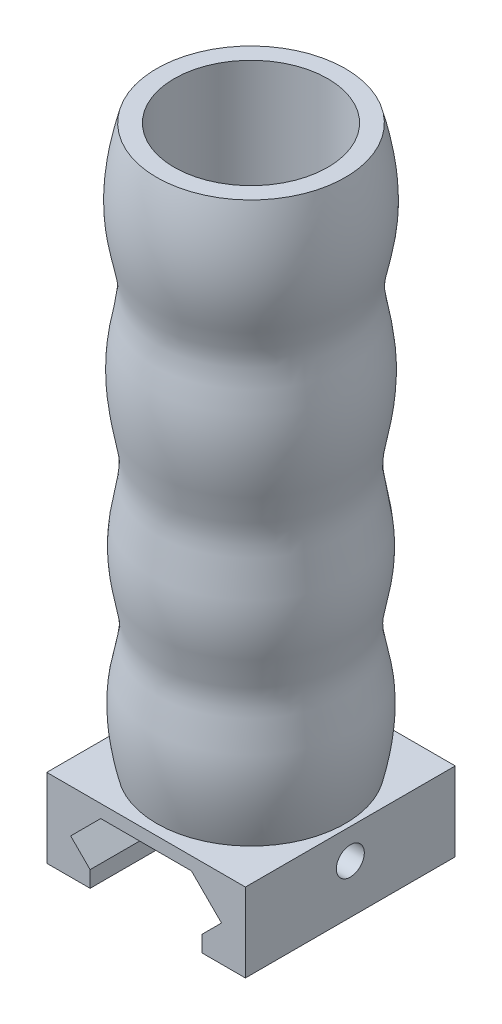
ISO-10303-21;
HEADER;
FILE_DESCRIPTION(('STEP AP214'),'2;1');
FILE_NAME('part.step','',(''),(''),'','','');
FILE_SCHEMA(('AUTOMOTIVE_DESIGN { 1 0 10303 214 1 1 1 1 }'));
ENDSEC;
DATA;
#1=APPLICATION_CONTEXT('core data for automotive mechanical design processes');
#2=APPLICATION_PROTOCOL_DEFINITION('international standard','automotive_design',2000,#1);
#3=PRODUCT_CONTEXT('',#1,'mechanical');
#4=PRODUCT('Part','Part','',(#3));
#5=PRODUCT_RELATED_PRODUCT_CATEGORY('part','',(#4));
#6=PRODUCT_DEFINITION_FORMATION('','',#4);
#7=PRODUCT_DEFINITION_CONTEXT('part definition',#1,'design');
#8=PRODUCT_DEFINITION('design','',#6,#7);
#9=PRODUCT_DEFINITION_SHAPE('','',#8);
#10=(LENGTH_UNIT() NAMED_UNIT(*) SI_UNIT(.MILLI.,.METRE.));
#11=(NAMED_UNIT(*) PLANE_ANGLE_UNIT() SI_UNIT($,.RADIAN.));
#12=(NAMED_UNIT(*) SI_UNIT($,.STERADIAN.) SOLID_ANGLE_UNIT());
#13=UNCERTAINTY_MEASURE_WITH_UNIT(LENGTH_MEASURE(1.E-05),#10,'distance_accuracy_value','');
#14=(GEOMETRIC_REPRESENTATION_CONTEXT(3) GLOBAL_UNCERTAINTY_ASSIGNED_CONTEXT((#13)) GLOBAL_UNIT_ASSIGNED_CONTEXT((#10,
#11,#12)) REPRESENTATION_CONTEXT('',''));
#15=CARTESIAN_POINT('',(0.,0.,0.));
#16=DIRECTION('',(0.,0.,1.));
#17=DIRECTION('',(1.,0.,0.));
#18=AXIS2_PLACEMENT_3D('',#15,#16,#17);
#19=CARTESIAN_POINT('',(14.2,13.7619104655193,30.));
#20=DIRECTION('',(0.,-1.,0.));
#21=DIRECTION('',(1.,0.,0.));
#22=AXIS2_PLACEMENT_3D('',#19,#20,#21);
#23=PLANE('',#22);
#24=DIRECTION('',(-1.,0.,0.));
#25=VECTOR('',#24,1.);
#26=CARTESIAN_POINT('',(14.2,13.7619104655193,0.));
#27=LINE('',#26,#25);
#28=CARTESIAN_POINT('',(14.2,13.7619104655193,0.));
#29=VERTEX_POINT('',#28);
#30=CARTESIAN_POINT('',(-14.2,13.7619104655193,0.));
#31=VERTEX_POINT('',#30);
#32=EDGE_CURVE('E205',#29,#31,#27,.T.);
#33=ORIENTED_EDGE('',*,*,#32,.T.);
#34=DIRECTION('',(0.,0.,-1.));
#35=VECTOR('',#34,1.);
#36=CARTESIAN_POINT('',(-14.2,13.7619104655193,30.));
#37=LINE('',#36,#35);
#38=CARTESIAN_POINT('',(-14.2,13.7619104655193,30.));
#39=VERTEX_POINT('',#38);
#40=EDGE_CURVE('E175',#39,#31,#37,.T.);
#41=ORIENTED_EDGE('',*,*,#40,.F.);
#42=DIRECTION('',(-1.,0.,0.));
#43=VECTOR('',#42,1.);
#44=CARTESIAN_POINT('',(14.2,13.7619104655193,30.));
#45=LINE('',#44,#43);
#46=CARTESIAN_POINT('',(14.2,13.7619104655193,30.));
#47=VERTEX_POINT('',#46);
#48=EDGE_CURVE('E249',#47,#39,#45,.T.);
#49=ORIENTED_EDGE('',*,*,#48,.F.);
#50=DIRECTION('',(0.,0.,-1.));
#51=VECTOR('',#50,1.);
#52=CARTESIAN_POINT('',(14.2,13.7619104655193,30.));
#53=LINE('',#52,#51);
#54=EDGE_CURVE('E178',#47,#29,#53,.T.);
#55=ORIENTED_EDGE('',*,*,#54,.T.);
#56=EDGE_LOOP('',(#33,#41,#49,#55));
#57=FACE_BOUND('',#56,.T.);
#58=CARTESIAN_POINT('',(0.,13.7619104655193,15.));
#59=DIRECTION('',(0.,-1.,0.));
#60=DIRECTION('',(0.,0.,-1.));
#61=AXIS2_PLACEMENT_3D('',#58,#59,#60);
#62=CIRCLE('',#61,13.4834031384401);
#63=CARTESIAN_POINT('',(0.,13.7619104655193,1.51659686155987));
#64=VERTEX_POINT('',#63);
#65=EDGE_CURVE('E11',#64,#64,#62,.F.);
#66=ORIENTED_EDGE('',*,*,#65,.F.);
#67=EDGE_LOOP('',(#66));
#68=FACE_BOUND('',#67,.T.);
#69=ADVANCED_FACE('F34',(#57,#68),#23,.F.);
#70=CARTESIAN_POINT('',(14.2,2.5,30.));
#71=DIRECTION('',(-1.,0.,0.));
#72=DIRECTION('',(0.,0.,1.));
#73=AXIS2_PLACEMENT_3D('',#70,#71,#72);
#74=PLANE('',#73);
#75=CARTESIAN_POINT('',(14.2,9.5,15.));
#76=DIRECTION('',(1.,0.,0.));
#77=DIRECTION('',(0.,1.,0.));
#78=AXIS2_PLACEMENT_3D('',#75,#76,#77);
#79=CIRCLE('',#78,2.);
#80=CARTESIAN_POINT('',(14.2,11.5,15.));
#81=VERTEX_POINT('',#80);
#82=EDGE_CURVE('E254',#81,#81,#79,.T.);
#83=ORIENTED_EDGE('',*,*,#82,.F.);
#84=EDGE_LOOP('',(#83));
#85=FACE_BOUND('',#84,.T.);
#86=DIRECTION('',(0.,1.,0.));
#87=VECTOR('',#86,1.);
#88=CARTESIAN_POINT('',(14.2,2.5,0.));
#89=LINE('',#88,#87);
#90=CARTESIAN_POINT('',(14.2,2.5,0.));
#91=VERTEX_POINT('',#90);
#92=EDGE_CURVE('E186',#91,#29,#89,.T.);
#93=ORIENTED_EDGE('',*,*,#92,.T.);
#94=ORIENTED_EDGE('',*,*,#54,.F.);
#95=DIRECTION('',(0.,1.,0.));
#96=VECTOR('',#95,1.);
#97=CARTESIAN_POINT('',(14.2,2.5,30.));
#98=LINE('',#97,#96);
#99=CARTESIAN_POINT('',(14.2,2.5,30.));
#100=VERTEX_POINT('',#99);
#101=EDGE_CURVE('E187',#100,#47,#98,.T.);
#102=ORIENTED_EDGE('',*,*,#101,.F.);
#103=DIRECTION('',(0.,0.,-1.));
#104=VECTOR('',#103,1.);
#105=CARTESIAN_POINT('',(14.2,2.5,30.));
#106=LINE('',#105,#104);
#107=EDGE_CURVE('E136',#100,#91,#106,.T.);
#108=ORIENTED_EDGE('',*,*,#107,.T.);
#109=EDGE_LOOP('',(#93,#94,#102,#108));
#110=FACE_BOUND('',#109,.T.);
#111=ADVANCED_FACE('F36',(#85,#110),#74,.F.);
#112=CARTESIAN_POINT('',(-14.2,2.5,30.));
#113=DIRECTION('',(1.,0.,0.));
#114=DIRECTION('',(0.,0.,-1.));
#115=AXIS2_PLACEMENT_3D('',#112,#113,#114);
#116=PLANE('',#115);
#117=CARTESIAN_POINT('',(-14.2,9.5,15.));
#118=DIRECTION('',(1.,0.,0.));
#119=DIRECTION('',(0.,1.,0.));
#120=AXIS2_PLACEMENT_3D('',#117,#118,#119);
#121=CIRCLE('',#120,2.);
#122=CARTESIAN_POINT('',(-14.2,11.5,15.));
#123=VERTEX_POINT('',#122);
#124=EDGE_CURVE('E146',#123,#123,#121,.T.);
#125=ORIENTED_EDGE('',*,*,#124,.T.);
#126=EDGE_LOOP('',(#125));
#127=FACE_BOUND('',#126,.T.);
#128=DIRECTION('',(0.,-1.,0.));
#129=VECTOR('',#128,1.);
#130=CARTESIAN_POINT('',(-14.2,2.5,0.));
#131=LINE('',#130,#129);
#132=CARTESIAN_POINT('',(-14.2,2.5,0.));
#133=VERTEX_POINT('',#132);
#134=EDGE_CURVE('E207',#31,#133,#131,.T.);
#135=ORIENTED_EDGE('',*,*,#134,.T.);
#136=DIRECTION('',(0.,0.,-1.));
#137=VECTOR('',#136,1.);
#138=CARTESIAN_POINT('',(-14.2,2.5,30.));
#139=LINE('',#138,#137);
#140=CARTESIAN_POINT('',(-14.2,2.5,30.));
#141=VERTEX_POINT('',#140);
#142=EDGE_CURVE('E172',#141,#133,#139,.T.);
#143=ORIENTED_EDGE('',*,*,#142,.F.);
#144=DIRECTION('',(0.,-1.,0.));
#145=VECTOR('',#144,1.);
#146=CARTESIAN_POINT('',(-14.2,2.5,30.));
#147=LINE('',#146,#145);
#148=EDGE_CURVE('E247',#39,#141,#147,.T.);
#149=ORIENTED_EDGE('',*,*,#148,.F.);
#150=ORIENTED_EDGE('',*,*,#40,.T.);
#151=EDGE_LOOP('',(#135,#143,#149,#150));
#152=FACE_BOUND('',#151,.T.);
#153=ADVANCED_FACE('F317',(#127,#152),#116,.F.);
#154=CARTESIAN_POINT('',(-8.,2.5,30.));
#155=DIRECTION('',(0.,1.,0.));
#156=DIRECTION('',(0.,0.,1.));
#157=AXIS2_PLACEMENT_3D('',#154,#155,#156);
#158=PLANE('',#157);
#159=DIRECTION('',(1.,0.,0.));
#160=VECTOR('',#159,1.);
#161=CARTESIAN_POINT('',(-8.,2.5,0.));
#162=LINE('',#161,#160);
#163=CARTESIAN_POINT('',(-8.,2.5,0.));
#164=VERTEX_POINT('',#163);
#165=EDGE_CURVE('E216',#133,#164,#162,.T.);
#166=ORIENTED_EDGE('',*,*,#165,.T.);
#167=DIRECTION('',(0.,0.,-1.));
#168=VECTOR('',#167,1.);
#169=CARTESIAN_POINT('',(-8.,2.5,30.));
#170=LINE('',#169,#168);
#171=CARTESIAN_POINT('',(-8.,2.5,30.));
#172=VERTEX_POINT('',#171);
#173=EDGE_CURVE('E169',#172,#164,#170,.T.);
#174=ORIENTED_EDGE('',*,*,#173,.F.);
#175=DIRECTION('',(1.,0.,0.));
#176=VECTOR('',#175,1.);
#177=CARTESIAN_POINT('',(-11.0828427124747,2.5,30.));
#178=LINE('',#177,#176);
#179=EDGE_CURVE('E245',#141,#172,#178,.T.);
#180=ORIENTED_EDGE('',*,*,#179,.F.);
#181=ORIENTED_EDGE('',*,*,#142,.T.);
#182=EDGE_LOOP('',(#166,#174,#180,#181));
#183=FACE_BOUND('',#182,.T.);
#184=ADVANCED_FACE('F313',(#183),#158,.F.);
#185=CARTESIAN_POINT('',(-8.,4.81715728752538,30.));
#186=DIRECTION('',(-1.,0.,0.));
#187=DIRECTION('',(0.,0.,1.));
#188=AXIS2_PLACEMENT_3D('',#185,#186,#187);
#189=PLANE('',#188);
#190=DIRECTION('',(0.,1.,0.));
#191=VECTOR('',#190,1.);
#192=CARTESIAN_POINT('',(-8.,4.81715728752538,0.));
#193=LINE('',#192,#191);
#194=CARTESIAN_POINT('',(-8.,4.81715728752538,0.));
#195=VERTEX_POINT('',#194);
#196=EDGE_CURVE('E218',#164,#195,#193,.T.);
#197=ORIENTED_EDGE('',*,*,#196,.T.);
#198=DIRECTION('',(0.,0.,-1.));
#199=VECTOR('',#198,1.);
#200=CARTESIAN_POINT('',(-8.,4.81715728752538,30.));
#201=LINE('',#200,#199);
#202=CARTESIAN_POINT('',(-8.,4.81715728752538,30.));
#203=VERTEX_POINT('',#202);
#204=EDGE_CURVE('E166',#203,#195,#201,.T.);
#205=ORIENTED_EDGE('',*,*,#204,.F.);
#206=DIRECTION('',(0.,1.,0.));
#207=VECTOR('',#206,1.);
#208=CARTESIAN_POINT('',(-8.,4.81715728752538,30.));
#209=LINE('',#208,#207);
#210=EDGE_CURVE('E243',#172,#203,#209,.T.);
#211=ORIENTED_EDGE('',*,*,#210,.F.);
#212=ORIENTED_EDGE('',*,*,#173,.T.);
#213=EDGE_LOOP('',(#197,#205,#211,#212));
#214=FACE_BOUND('',#213,.T.);
#215=ADVANCED_FACE('F309',(#214),#189,.F.);
#216=CARTESIAN_POINT('',(-10.7828427124746,7.6,30.));
#217=DIRECTION('',(-0.707106781186547,-0.707106781186548,0.));
#218=DIRECTION('',(0.707106781186548,-0.707106781186547,0.));
#219=AXIS2_PLACEMENT_3D('',#216,#217,#218);
#220=PLANE('',#219);
#221=DIRECTION('',(0.,0.,-1.));
#222=VECTOR('',#221,1.);
#223=CARTESIAN_POINT('',(-10.7828427124746,7.6,30.));
#224=LINE('',#223,#222);
#225=CARTESIAN_POINT('',(-10.7828427124746,7.6,14.3755002001602));
#226=VERTEX_POINT('',#225);
#227=CARTESIAN_POINT('',(-10.7828427124746,7.6,0.));
#228=VERTEX_POINT('',#227);
#229=EDGE_CURVE('E162',#226,#228,#224,.T.);
#230=ORIENTED_EDGE('',*,*,#229,.F.);
#231=CARTESIAN_POINT('',(-12.6828427124746,9.5,15.));
#232=DIRECTION('',(-0.707106781186547,-0.707106781186548,0.));
#233=DIRECTION('',(0.707106781186548,-0.707106781186547,0.));
#234=AXIS2_PLACEMENT_3D('',#231,#232,#233);
#235=ELLIPSE('',#234,2.82842712474619,2.);
#236=CARTESIAN_POINT('',(-10.7828427124746,7.6,15.6244997998399));
#237=VERTEX_POINT('',#236);
#238=EDGE_CURVE('E48',#226,#237,#235,.T.);
#239=ORIENTED_EDGE('',*,*,#238,.T.);
#240=CARTESIAN_POINT('',(-10.7828427124746,7.6,30.));
#241=VERTEX_POINT('',#240);
#242=EDGE_CURVE('E163',#241,#237,#224,.T.);
#243=ORIENTED_EDGE('',*,*,#242,.F.);
#244=DIRECTION('',(-0.707106781186548,0.707106781186547,0.));
#245=VECTOR('',#244,1.);
#246=CARTESIAN_POINT('',(-10.7828427124746,7.6,30.));
#247=LINE('',#246,#245);
#248=EDGE_CURVE('E241',#203,#241,#247,.T.);
#249=ORIENTED_EDGE('',*,*,#248,.F.);
#250=ORIENTED_EDGE('',*,*,#204,.T.);
#251=DIRECTION('',(-0.707106781186548,0.707106781186547,0.));
#252=VECTOR('',#251,1.);
#253=CARTESIAN_POINT('',(-10.7828427124746,7.6,0.));
#254=LINE('',#253,#252);
#255=EDGE_CURVE('E220',#195,#228,#254,.T.);
#256=ORIENTED_EDGE('',*,*,#255,.T.);
#257=EDGE_LOOP('',(#230,#239,#243,#249,#250,#256));
#258=FACE_BOUND('',#257,.T.);
#259=ADVANCED_FACE('F305',(#258),#220,.F.);
#260=CARTESIAN_POINT('',(-6.48284271247462,11.9,30.));
#261=DIRECTION('',(-0.707106781186547,0.707106781186547,0.));
#262=DIRECTION('',(-0.707106781186548,-0.707106781186548,0.));
#263=AXIS2_PLACEMENT_3D('',#260,#261,#262);
#264=PLANE('',#263);
#265=ORIENTED_EDGE('',*,*,#242,.T.);
#266=CARTESIAN_POINT('',(-8.88284271247462,9.5,15.));
#267=DIRECTION('',(-0.707106781186547,0.707106781186547,0.));
#268=DIRECTION('',(0.707106781186548,0.707106781186548,0.));
#269=AXIS2_PLACEMENT_3D('',#266,#267,#268);
#270=ELLIPSE('',#269,2.82842712474619,2.);
#271=EDGE_CURVE('E145',#237,#226,#270,.T.);
#272=ORIENTED_EDGE('',*,*,#271,.T.);
#273=ORIENTED_EDGE('',*,*,#229,.T.);
#274=DIRECTION('',(0.707106781186548,0.707106781186548,0.));
#275=VECTOR('',#274,1.);
#276=CARTESIAN_POINT('',(-6.48284271247462,11.9,0.));
#277=LINE('',#276,#275);
#278=CARTESIAN_POINT('',(-6.48284271247462,11.9,0.));
#279=VERTEX_POINT('',#278);
#280=EDGE_CURVE('E223',#228,#279,#277,.T.);
#281=ORIENTED_EDGE('',*,*,#280,.T.);
#282=DIRECTION('',(0.,0.,-1.));
#283=VECTOR('',#282,1.);
#284=CARTESIAN_POINT('',(-6.48284271247462,11.9,30.));
#285=LINE('',#284,#283);
#286=CARTESIAN_POINT('',(-6.48284271247462,11.9,30.));
#287=VERTEX_POINT('',#286);
#288=EDGE_CURVE('E154',#287,#279,#285,.T.);
#289=ORIENTED_EDGE('',*,*,#288,.F.);
#290=DIRECTION('',(0.707106781186548,0.707106781186548,0.));
#291=VECTOR('',#290,1.);
#292=CARTESIAN_POINT('',(-6.48284271247462,11.9,30.));
#293=LINE('',#292,#291);
#294=EDGE_CURVE('E239',#241,#287,#293,.T.);
#295=ORIENTED_EDGE('',*,*,#294,.F.);
#296=EDGE_LOOP('',(#265,#272,#273,#281,#289,#295));
#297=FACE_BOUND('',#296,.T.);
#298=ADVANCED_FACE('F301',(#297),#264,.F.);
#299=CARTESIAN_POINT('',(6.48284271247462,11.9,30.));
#300=DIRECTION('',(0.,1.,0.));
#301=DIRECTION('',(0.,0.,1.));
#302=AXIS2_PLACEMENT_3D('',#299,#300,#301);
#303=PLANE('',#302);
#304=DIRECTION('',(1.,0.,0.));
#305=VECTOR('',#304,1.);
#306=CARTESIAN_POINT('',(6.48284271247462,11.9,0.));
#307=LINE('',#306,#305);
#308=CARTESIAN_POINT('',(6.48284271247462,11.9,0.));
#309=VERTEX_POINT('',#308);
#310=EDGE_CURVE('E225',#279,#309,#307,.T.);
#311=ORIENTED_EDGE('',*,*,#310,.T.);
#312=DIRECTION('',(0.,0.,-1.));
#313=VECTOR('',#312,1.);
#314=CARTESIAN_POINT('',(6.48284271247462,11.9,30.));
#315=LINE('',#314,#313);
#316=CARTESIAN_POINT('',(6.48284271247462,11.9,30.));
#317=VERTEX_POINT('',#316);
#318=EDGE_CURVE('E151',#317,#309,#315,.T.);
#319=ORIENTED_EDGE('',*,*,#318,.F.);
#320=DIRECTION('',(1.,0.,0.));
#321=VECTOR('',#320,1.);
#322=CARTESIAN_POINT('',(6.48284271247462,11.9,30.));
#323=LINE('',#322,#321);
#324=EDGE_CURVE('E235',#287,#317,#323,.T.);
#325=ORIENTED_EDGE('',*,*,#324,.F.);
#326=ORIENTED_EDGE('',*,*,#288,.T.);
#327=EDGE_LOOP('',(#311,#319,#325,#326));
#328=FACE_BOUND('',#327,.T.);
#329=ADVANCED_FACE('F298',(#328),#303,.F.);
#330=CARTESIAN_POINT('',(10.7828427124746,7.6,30.));
#331=DIRECTION('',(0.707106781186547,0.707106781186547,0.));
#332=DIRECTION('',(-0.707106781186548,0.707106781186548,0.));
#333=AXIS2_PLACEMENT_3D('',#330,#331,#332);
#334=PLANE('',#333);
#335=DIRECTION('',(0.,0.,-1.));
#336=VECTOR('',#335,1.);
#337=CARTESIAN_POINT('',(10.7828427124746,7.6,30.));
#338=LINE('',#337,#336);
#339=CARTESIAN_POINT('',(10.7828427124746,7.6,14.3755002001602));
#340=VERTEX_POINT('',#339);
#341=CARTESIAN_POINT('',(10.7828427124746,7.6,0.));
#342=VERTEX_POINT('',#341);
#343=EDGE_CURVE('E144',#340,#342,#338,.T.);
#344=ORIENTED_EDGE('',*,*,#343,.F.);
#345=CARTESIAN_POINT('',(8.88284271247462,9.5,15.));
#346=DIRECTION('',(0.707106781186547,0.707106781186547,0.));
#347=DIRECTION('',(0.707106781186548,-0.707106781186548,0.));
#348=AXIS2_PLACEMENT_3D('',#345,#346,#347);
#349=ELLIPSE('',#348,2.82842712474619,2.);
#350=CARTESIAN_POINT('',(10.7828427124746,7.6,15.6244997998398));
#351=VERTEX_POINT('',#350);
#352=EDGE_CURVE('E55',#340,#351,#349,.T.);
#353=ORIENTED_EDGE('',*,*,#352,.T.);
#354=CARTESIAN_POINT('',(10.7828427124746,7.6,30.));
#355=VERTEX_POINT('',#354);
#356=EDGE_CURVE('E141',#355,#351,#338,.T.);
#357=ORIENTED_EDGE('',*,*,#356,.F.);
#358=DIRECTION('',(0.707106781186547,-0.707106781186547,0.));
#359=VECTOR('',#358,1.);
#360=CARTESIAN_POINT('',(10.7828427124746,7.6,30.));
#361=LINE('',#360,#359);
#362=EDGE_CURVE('E234',#317,#355,#361,.T.);
#363=ORIENTED_EDGE('',*,*,#362,.F.);
#364=ORIENTED_EDGE('',*,*,#318,.T.);
#365=DIRECTION('',(0.707106781186547,-0.707106781186547,0.));
#366=VECTOR('',#365,1.);
#367=CARTESIAN_POINT('',(10.7828427124746,7.6,0.));
#368=LINE('',#367,#366);
#369=EDGE_CURVE('E227',#309,#342,#368,.T.);
#370=ORIENTED_EDGE('',*,*,#369,.T.);
#371=EDGE_LOOP('',(#344,#353,#357,#363,#364,#370));
#372=FACE_BOUND('',#371,.T.);
#373=ADVANCED_FACE('F139',(#372),#334,.F.);
#374=CARTESIAN_POINT('',(8.,4.81715728752538,30.));
#375=DIRECTION('',(0.707106781186547,-0.707106781186547,0.));
#376=DIRECTION('',(0.707106781186548,0.707106781186548,0.));
#377=AXIS2_PLACEMENT_3D('',#374,#375,#376);
#378=PLANE('',#377);
#379=ORIENTED_EDGE('',*,*,#356,.T.);
#380=CARTESIAN_POINT('',(12.6828427124746,9.5,15.));
#381=DIRECTION('',(0.707106781186547,-0.707106781186547,0.));
#382=DIRECTION('',(0.707106781186548,0.707106781186548,0.));
#383=AXIS2_PLACEMENT_3D('',#380,#381,#382);
#384=ELLIPSE('',#383,2.82842712474619,2.);
#385=EDGE_CURVE('E42',#351,#340,#384,.T.);
#386=ORIENTED_EDGE('',*,*,#385,.T.);
#387=ORIENTED_EDGE('',*,*,#343,.T.);
#388=DIRECTION('',(-0.707106781186548,-0.707106781186548,0.));
#389=VECTOR('',#388,1.);
#390=CARTESIAN_POINT('',(8.,4.81715728752538,0.));
#391=LINE('',#390,#389);
#392=CARTESIAN_POINT('',(8.,4.81715728752538,0.));
#393=VERTEX_POINT('',#392);
#394=EDGE_CURVE('E229',#342,#393,#391,.T.);
#395=ORIENTED_EDGE('',*,*,#394,.T.);
#396=DIRECTION('',(0.,0.,-1.));
#397=VECTOR('',#396,1.);
#398=CARTESIAN_POINT('',(8.,4.81715728752538,30.));
#399=LINE('',#398,#397);
#400=CARTESIAN_POINT('',(8.,4.81715728752538,30.));
#401=VERTEX_POINT('',#400);
#402=EDGE_CURVE('E156',#401,#393,#399,.T.);
#403=ORIENTED_EDGE('',*,*,#402,.F.);
#404=DIRECTION('',(-0.707106781186548,-0.707106781186548,0.));
#405=VECTOR('',#404,1.);
#406=CARTESIAN_POINT('',(8.,4.81715728752538,30.));
#407=LINE('',#406,#405);
#408=EDGE_CURVE('E150',#355,#401,#407,.T.);
#409=ORIENTED_EDGE('',*,*,#408,.F.);
#410=EDGE_LOOP('',(#379,#386,#387,#395,#403,#409));
#411=FACE_BOUND('',#410,.T.);
#412=ADVANCED_FACE('F148',(#411),#378,.F.);
#413=CARTESIAN_POINT('',(8.,2.5,30.));
#414=DIRECTION('',(1.,0.,0.));
#415=DIRECTION('',(0.,0.,-1.));
#416=AXIS2_PLACEMENT_3D('',#413,#414,#415);
#417=PLANE('',#416);
#418=DIRECTION('',(0.,-1.,0.));
#419=VECTOR('',#418,1.);
#420=CARTESIAN_POINT('',(8.,2.5,0.));
#421=LINE('',#420,#419);
#422=CARTESIAN_POINT('',(8.,2.5,0.));
#423=VERTEX_POINT('',#422);
#424=EDGE_CURVE('E200',#393,#423,#421,.T.);
#425=ORIENTED_EDGE('',*,*,#424,.T.);
#426=DIRECTION('',(0.,0.,-1.));
#427=VECTOR('',#426,1.);
#428=CARTESIAN_POINT('',(8.,2.5,30.));
#429=LINE('',#428,#427);
#430=CARTESIAN_POINT('',(8.,2.5,30.));
#431=VERTEX_POINT('',#430);
#432=EDGE_CURVE('E197',#431,#423,#429,.T.);
#433=ORIENTED_EDGE('',*,*,#432,.F.);
#434=DIRECTION('',(0.,-1.,0.));
#435=VECTOR('',#434,1.);
#436=CARTESIAN_POINT('',(8.,2.5,30.));
#437=LINE('',#436,#435);
#438=EDGE_CURVE('E211',#401,#431,#437,.T.);
#439=ORIENTED_EDGE('',*,*,#438,.F.);
#440=ORIENTED_EDGE('',*,*,#402,.T.);
#441=EDGE_LOOP('',(#425,#433,#439,#440));
#442=FACE_BOUND('',#441,.T.);
#443=ADVANCED_FACE('F290',(#442),#417,.F.);
#444=CARTESIAN_POINT('',(11.0828427124746,2.5,30.));
#445=DIRECTION('',(0.,1.,0.));
#446=DIRECTION('',(0.,0.,1.));
#447=AXIS2_PLACEMENT_3D('',#444,#445,#446);
#448=PLANE('',#447);
#449=DIRECTION('',(1.,0.,0.));
#450=VECTOR('',#449,1.);
#451=CARTESIAN_POINT('',(11.0828427124746,2.5,0.));
#452=LINE('',#451,#450);
#453=EDGE_CURVE('E195',#423,#91,#452,.T.);
#454=ORIENTED_EDGE('',*,*,#453,.T.);
#455=ORIENTED_EDGE('',*,*,#107,.F.);
#456=DIRECTION('',(1.,0.,0.));
#457=VECTOR('',#456,1.);
#458=CARTESIAN_POINT('',(11.0828427124746,2.5,30.));
#459=LINE('',#458,#457);
#460=EDGE_CURVE('E192',#431,#100,#459,.T.);
#461=ORIENTED_EDGE('',*,*,#460,.F.);
#462=ORIENTED_EDGE('',*,*,#432,.T.);
#463=EDGE_LOOP('',(#454,#455,#461,#462));
#464=FACE_BOUND('',#463,.T.);
#465=ADVANCED_FACE('F190',(#464),#448,.F.);
#466=CARTESIAN_POINT('',(0.,0.,30.));
#467=DIRECTION('',(0.,0.,1.));
#468=DIRECTION('',(1.,0.,0.));
#469=AXIS2_PLACEMENT_3D('',#466,#467,#468);
#470=PLANE('',#469);
#471=ORIENTED_EDGE('',*,*,#460,.T.);
#472=ORIENTED_EDGE('',*,*,#101,.T.);
#473=ORIENTED_EDGE('',*,*,#48,.T.);
#474=ORIENTED_EDGE('',*,*,#148,.T.);
#475=ORIENTED_EDGE('',*,*,#179,.T.);
#476=ORIENTED_EDGE('',*,*,#210,.T.);
#477=ORIENTED_EDGE('',*,*,#248,.T.);
#478=ORIENTED_EDGE('',*,*,#294,.T.);
#479=ORIENTED_EDGE('',*,*,#324,.T.);
#480=ORIENTED_EDGE('',*,*,#362,.T.);
#481=ORIENTED_EDGE('',*,*,#408,.T.);
#482=ORIENTED_EDGE('',*,*,#438,.T.);
#483=EDGE_LOOP('',(#471,#472,#473,#474,#475,#476,#477,#478,#479,#480,#481,#482));
#484=FACE_BOUND('',#483,.T.);
#485=ADVANCED_FACE('F283',(#484),#470,.T.);
#486=CARTESIAN_POINT('',(0.,0.,0.));
#487=DIRECTION('',(0.,0.,1.));
#488=DIRECTION('',(1.,0.,0.));
#489=AXIS2_PLACEMENT_3D('',#486,#487,#488);
#490=PLANE('',#489);
#491=ORIENTED_EDGE('',*,*,#92,.F.);
#492=ORIENTED_EDGE('',*,*,#453,.F.);
#493=ORIENTED_EDGE('',*,*,#424,.F.);
#494=ORIENTED_EDGE('',*,*,#394,.F.);
#495=ORIENTED_EDGE('',*,*,#369,.F.);
#496=ORIENTED_EDGE('',*,*,#310,.F.);
#497=ORIENTED_EDGE('',*,*,#280,.F.);
#498=ORIENTED_EDGE('',*,*,#255,.F.);
#499=ORIENTED_EDGE('',*,*,#196,.F.);
#500=ORIENTED_EDGE('',*,*,#165,.F.);
#501=ORIENTED_EDGE('',*,*,#134,.F.);
#502=ORIENTED_EDGE('',*,*,#32,.F.);
#503=EDGE_LOOP('',(#491,#492,#493,#494,#495,#496,#497,#498,#499,#500,#501,#502));
#504=FACE_BOUND('',#503,.T.);
#505=ADVANCED_FACE('F203',(#504),#490,.F.);
#506=CARTESIAN_POINT('',(-14.2,9.5,15.));
#507=DIRECTION('',(1.,0.,0.));
#508=DIRECTION('',(0.,1.,0.));
#509=AXIS2_PLACEMENT_3D('',#506,#507,#508);
#510=CYLINDRICAL_SURFACE('',#509,2.);
#511=ORIENTED_EDGE('',*,*,#82,.T.);
#512=EDGE_LOOP('',(#511));
#513=FACE_BOUND('',#512,.T.);
#514=ORIENTED_EDGE('',*,*,#385,.F.);
#515=ORIENTED_EDGE('',*,*,#352,.F.);
#516=EDGE_LOOP('',(#514,#515));
#517=FACE_BOUND('',#516,.T.);
#518=ADVANCED_FACE('F132',(#513,#517),#510,.F.);
#519=ORIENTED_EDGE('',*,*,#124,.F.);
#520=EDGE_LOOP('',(#519));
#521=FACE_BOUND('',#520,.T.);
#522=ORIENTED_EDGE('',*,*,#271,.F.);
#523=ORIENTED_EDGE('',*,*,#238,.F.);
#524=EDGE_LOOP('',(#522,#523));
#525=FACE_BOUND('',#524,.T.);
#526=ADVANCED_FACE('F277',(#521,#525),#510,.F.);
#527=CARTESIAN_POINT('',(0.,93.7619104655193,28.4834031384401));
#528=CARTESIAN_POINT('',(0.,82.01744674886,31.6459283712119));
#529=CARTESIAN_POINT('',(0.,74.2458540051905,25.7753890519115));
#530=CARTESIAN_POINT('',(0.,65.5653333415322,31.1948075502342));
#531=CARTESIAN_POINT('',(0.,49.1329919368262,27.2955775926142));
#532=CARTESIAN_POINT('',(0.,43.557319505267,30.9130647867332));
#533=CARTESIAN_POINT('',(0.,28.7622369373881,27.1213779056209));
#534=CARTESIAN_POINT('',(0.,24.6922963145273,31.1450867373991));
#535=CARTESIAN_POINT('',(0.,13.7619104655193,28.4834031384401));
#536=B_SPLINE_CURVE_WITH_KNOTS('',3,(#527,#528,#529,#530,#531,#532,#533,#534,#535),
.UNSPECIFIED.,.F.,.F.,(4,1,1,1,1,1,4),(0.,0.360238987321969,0.68445407591175,0.738796110234586,
0.885341194959695,0.9132933974953,1.),.UNSPECIFIED.);
#537=CARTESIAN_POINT('',(0.,13.7619104655193,15.));
#538=DIRECTION('',(0.,-1.,0.));
#539=AXIS1_PLACEMENT('',#537,#538);
#540=SURFACE_OF_REVOLUTION('',#536,#539);
#541=ORIENTED_EDGE('',*,*,#65,.T.);
#542=EDGE_LOOP('',(#541));
#543=FACE_BOUND('',#542,.T.);
#544=CARTESIAN_POINT('',(0.,93.7619104655193,15.));
#545=DIRECTION('',(0.,-1.,0.));
#546=DIRECTION('',(0.,0.,-1.));
#547=AXIS2_PLACEMENT_3D('',#544,#545,#546);
#548=CIRCLE('',#547,13.4834031384401);
#549=CARTESIAN_POINT('',(0.,93.7619104655193,1.51659686155987));
#550=VERTEX_POINT('',#549);
#551=EDGE_CURVE('E257',#550,#550,#548,.T.);
#552=ORIENTED_EDGE('',*,*,#551,.T.);
#553=EDGE_LOOP('',(#552));
#554=FACE_BOUND('',#553,.T.);
#555=ADVANCED_FACE('F272',(#543,#554),#540,.T.);
#556=CARTESIAN_POINT('',(0.,93.7619104655193,28.4834031384401));
#557=DIRECTION('',(0.,-1.,0.));
#558=DIRECTION('',(0.,0.,-1.));
#559=AXIS2_PLACEMENT_3D('',#556,#557,#558);
#560=PLANE('',#559);
#561=CARTESIAN_POINT('',(0.,93.7619104655193,15.));
#562=DIRECTION('',(0.,1.,0.));
#563=DIRECTION('',(0.,0.,1.));
#564=AXIS2_PLACEMENT_3D('',#561,#562,#563);
#565=CIRCLE('',#564,10.9834031384401);
#566=CARTESIAN_POINT('',(0.,93.7619104655193,25.9834031384401));
#567=VERTEX_POINT('',#566);
#568=EDGE_CURVE('E343',#567,#567,#565,.T.);
#569=ORIENTED_EDGE('',*,*,#568,.F.);
#570=EDGE_LOOP('',(#569));
#571=FACE_BOUND('',#570,.T.);
#572=ORIENTED_EDGE('',*,*,#551,.F.);
#573=EDGE_LOOP('',(#572));
#574=FACE_BOUND('',#573,.T.);
#575=ADVANCED_FACE('F276',(#571,#574),#560,.F.);
#576=CARTESIAN_POINT('',(14.2,13.7619104655193,30.));
#577=DIRECTION('',(0.,-1.,0.));
#578=DIRECTION('',(1.,0.,0.));
#579=AXIS2_PLACEMENT_3D('',#576,#577,#578);
#580=PLANE('',#579);
#581=CARTESIAN_POINT('',(0.,13.7619104655193,15.));
#582=DIRECTION('',(0.,-1.,0.));
#583=DIRECTION('',(1.,0.,0.));
#584=AXIS2_PLACEMENT_3D('',#581,#582,#583);
#585=CIRCLE('',#584,10.9834031384401);
#586=CARTESIAN_POINT('',(10.9834031384401,13.7619104655193,15.));
#587=VERTEX_POINT('',#586);
#588=EDGE_CURVE('E262',#587,#587,#585,.F.);
#589=ORIENTED_EDGE('',*,*,#588,.T.);
#590=EDGE_LOOP('',(#589));
#591=FACE_BOUND('',#590,.T.);
#592=ADVANCED_FACE('F334',(#591),#580,.F.);
#593=CARTESIAN_POINT('',(0.,-17.3038448932672,15.));
#594=DIRECTION('',(0.,1.,0.));
#595=DIRECTION('',(0.,0.,1.));
#596=AXIS2_PLACEMENT_3D('',#593,#594,#595);
#597=CYLINDRICAL_SURFACE('',#596,10.9834031384401);
#598=ORIENTED_EDGE('',*,*,#568,.T.);
#599=EDGE_LOOP('',(#598));
#600=FACE_BOUND('',#599,.T.);
#601=ORIENTED_EDGE('',*,*,#588,.F.);
#602=EDGE_LOOP('',(#601));
#603=FACE_BOUND('',#602,.T.);
#604=ADVANCED_FACE('F339',(#600,#603),#597,.F.);
#605=CLOSED_SHELL('',(#69,#111,#153,#184,#215,#259,#298,#329,#373,#412,#443,#465,#485,#505,#518,
#526,#555,#575,#592,#604));
#606=MANIFOLD_SOLID_BREP('B2',#605);
#607=ADVANCED_BREP_SHAPE_REPRESENTATION('',(#18,#606),#14);
#608=SHAPE_DEFINITION_REPRESENTATION(#9,#607);
ENDSEC;
END-ISO-10303-21;
